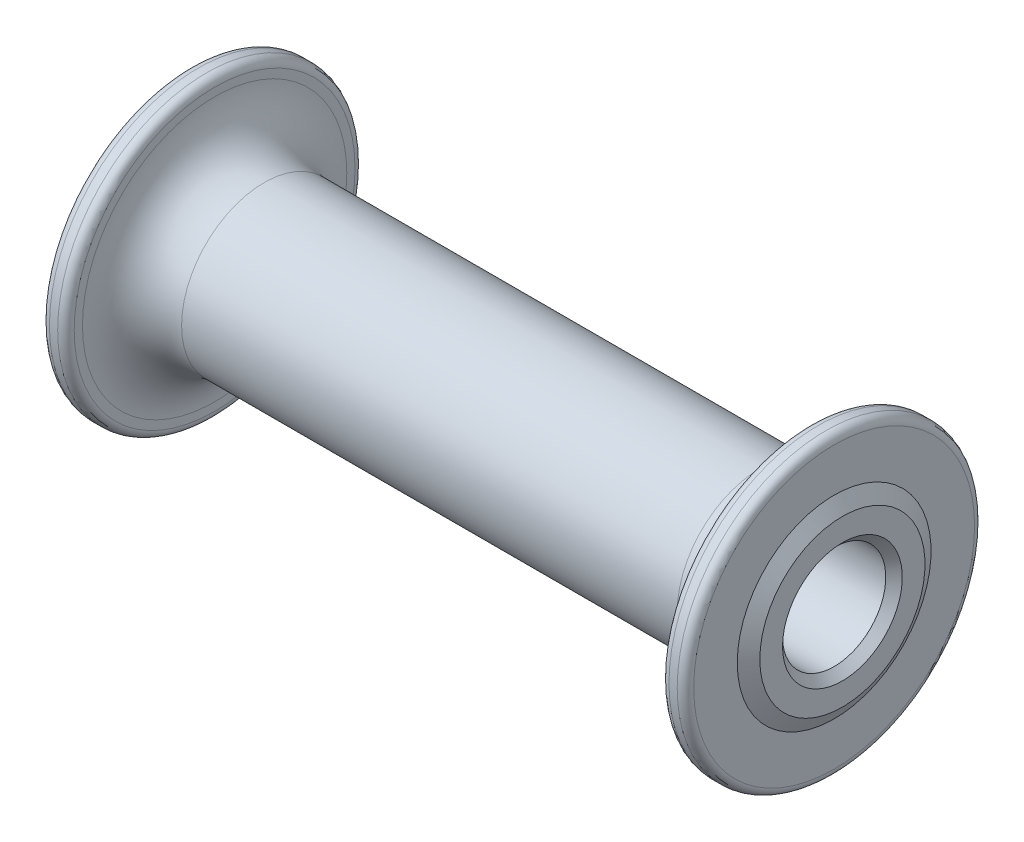
ISO-10303-21;
HEADER;
FILE_DESCRIPTION(('STEP AP214'),'2;1');
FILE_NAME('part.step','',(''),(''),'','','');
FILE_SCHEMA(('AUTOMOTIVE_DESIGN { 1 0 10303 214 1 1 1 1 }'));
ENDSEC;
DATA;
#1=APPLICATION_CONTEXT('core data for automotive mechanical design processes');
#2=APPLICATION_PROTOCOL_DEFINITION('international standard','automotive_design',2000,#1);
#3=PRODUCT_CONTEXT('',#1,'mechanical');
#4=PRODUCT('Part','Part','',(#3));
#5=PRODUCT_RELATED_PRODUCT_CATEGORY('part','',(#4));
#6=PRODUCT_DEFINITION_FORMATION('','',#4);
#7=PRODUCT_DEFINITION_CONTEXT('part definition',#1,'design');
#8=PRODUCT_DEFINITION('design','',#6,#7);
#9=PRODUCT_DEFINITION_SHAPE('','',#8);
#10=(LENGTH_UNIT() NAMED_UNIT(*) SI_UNIT(.MILLI.,.METRE.));
#11=(NAMED_UNIT(*) PLANE_ANGLE_UNIT() SI_UNIT($,.RADIAN.));
#12=(NAMED_UNIT(*) SI_UNIT($,.STERADIAN.) SOLID_ANGLE_UNIT());
#13=UNCERTAINTY_MEASURE_WITH_UNIT(LENGTH_MEASURE(1.E-05),#10,'distance_accuracy_value','');
#14=(GEOMETRIC_REPRESENTATION_CONTEXT(3) GLOBAL_UNCERTAINTY_ASSIGNED_CONTEXT((#13)) GLOBAL_UNIT_ASSIGNED_CONTEXT((#10,
#11,#12)) REPRESENTATION_CONTEXT('',''));
#15=CARTESIAN_POINT('',(0.,0.,0.));
#16=DIRECTION('',(0.,0.,1.));
#17=DIRECTION('',(1.,0.,0.));
#18=AXIS2_PLACEMENT_3D('',#15,#16,#17);
#19=CARTESIAN_POINT('',(40.,0.,0.));
#20=DIRECTION('',(-1.,0.,0.));
#21=DIRECTION('',(0.,0.,1.));
#22=AXIS2_PLACEMENT_3D('',#19,#20,#21);
#23=CONICAL_SURFACE('',#22,10.,1.0471975511966);
#24=CARTESIAN_POINT('',(39.,0.,0.));
#25=DIRECTION('',(-1.,0.,0.));
#26=DIRECTION('',(0.,0.,1.));
#27=AXIS2_PLACEMENT_3D('',#24,#25,#26);
#28=CIRCLE('',#27,11.7320508075689);
#29=CARTESIAN_POINT('',(39.,0.,11.7320508075689));
#30=VERTEX_POINT('',#29);
#31=EDGE_CURVE('E50',#30,#30,#28,.T.);
#32=ORIENTED_EDGE('',*,*,#31,.F.);
#33=EDGE_LOOP('',(#32));
#34=FACE_BOUND('',#33,.T.);
#35=CARTESIAN_POINT('',(40.,0.,0.));
#36=DIRECTION('',(-1.,0.,0.));
#37=DIRECTION('',(0.,0.,1.));
#38=AXIS2_PLACEMENT_3D('',#35,#36,#37);
#39=CIRCLE('',#38,10.);
#40=CARTESIAN_POINT('',(40.,0.,10.));
#41=VERTEX_POINT('',#40);
#42=EDGE_CURVE('E95',#41,#41,#39,.T.);
#43=ORIENTED_EDGE('',*,*,#42,.T.);
#44=EDGE_LOOP('',(#43));
#45=FACE_BOUND('',#44,.T.);
#46=ADVANCED_FACE('F30',(#34,#45),#23,.T.);
#47=CARTESIAN_POINT('',(39.,11.7320508075689,0.));
#48=DIRECTION('',(-1.,0.,0.));
#49=DIRECTION('',(0.,0.,1.));
#50=AXIS2_PLACEMENT_3D('',#47,#48,#49);
#51=PLANE('',#50);
#52=CARTESIAN_POINT('',(39.,0.,0.));
#53=DIRECTION('',(-1.,0.,0.));
#54=DIRECTION('',(0.,0.,1.));
#55=AXIS2_PLACEMENT_3D('',#52,#53,#54);
#56=CIRCLE('',#55,17.);
#57=CARTESIAN_POINT('',(39.,0.,17.));
#58=VERTEX_POINT('',#57);
#59=EDGE_CURVE('E53',#58,#58,#56,.T.);
#60=ORIENTED_EDGE('',*,*,#59,.F.);
#61=EDGE_LOOP('',(#60));
#62=FACE_BOUND('',#61,.T.);
#63=ORIENTED_EDGE('',*,*,#31,.T.);
#64=EDGE_LOOP('',(#63));
#65=FACE_BOUND('',#64,.T.);
#66=ADVANCED_FACE('F114',(#62,#65),#51,.F.);
#67=CARTESIAN_POINT('',(38.,0.,0.));
#68=DIRECTION('',(-1.,0.,0.));
#69=DIRECTION('',(0.,0.,1.));
#70=AXIS2_PLACEMENT_3D('',#67,#68,#69);
#71=TOROIDAL_SURFACE('',#70,17.,1.);
#72=CARTESIAN_POINT('',(38.,0.,0.));
#73=DIRECTION('',(-1.,0.,0.));
#74=DIRECTION('',(0.,0.,1.));
#75=AXIS2_PLACEMENT_3D('',#72,#73,#74);
#76=CIRCLE('',#75,18.);
#77=CARTESIAN_POINT('',(38.,0.,18.));
#78=VERTEX_POINT('',#77);
#79=EDGE_CURVE('E56',#78,#78,#76,.T.);
#80=ORIENTED_EDGE('',*,*,#79,.F.);
#81=EDGE_LOOP('',(#80));
#82=FACE_BOUND('',#81,.T.);
#83=ORIENTED_EDGE('',*,*,#59,.T.);
#84=EDGE_LOOP('',(#83));
#85=FACE_BOUND('',#84,.T.);
#86=ADVANCED_FACE('F120',(#82,#85),#71,.T.);
#87=CARTESIAN_POINT('',(0.,0.,0.));
#88=DIRECTION('',(-1.,0.,0.));
#89=DIRECTION('',(0.,0.,1.));
#90=AXIS2_PLACEMENT_3D('',#87,#88,#89);
#91=CYLINDRICAL_SURFACE('',#90,18.);
#92=CARTESIAN_POINT('',(37.,0.,0.));
#93=DIRECTION('',(-1.,0.,0.));
#94=DIRECTION('',(0.,0.,1.));
#95=AXIS2_PLACEMENT_3D('',#92,#93,#94);
#96=CIRCLE('',#95,18.);
#97=CARTESIAN_POINT('',(37.,0.,18.));
#98=VERTEX_POINT('',#97);
#99=EDGE_CURVE('E59',#98,#98,#96,.T.);
#100=ORIENTED_EDGE('',*,*,#99,.F.);
#101=EDGE_LOOP('',(#100));
#102=FACE_BOUND('',#101,.T.);
#103=ORIENTED_EDGE('',*,*,#79,.T.);
#104=EDGE_LOOP('',(#103));
#105=FACE_BOUND('',#104,.T.);
#106=ADVANCED_FACE('F127',(#102,#105),#91,.T.);
#107=CARTESIAN_POINT('',(37.,0.,0.));
#108=DIRECTION('',(-1.,0.,0.));
#109=DIRECTION('',(0.,0.,1.));
#110=AXIS2_PLACEMENT_3D('',#107,#108,#109);
#111=TOROIDAL_SURFACE('',#110,17.,0.999999999999999);
#112=CARTESIAN_POINT('',(36.,0.,0.));
#113=DIRECTION('',(-1.,0.,0.));
#114=DIRECTION('',(0.,0.,1.));
#115=AXIS2_PLACEMENT_3D('',#112,#113,#114);
#116=CIRCLE('',#115,17.);
#117=CARTESIAN_POINT('',(36.,0.,17.));
#118=VERTEX_POINT('',#117);
#119=EDGE_CURVE('E62',#118,#118,#116,.T.);
#120=ORIENTED_EDGE('',*,*,#119,.F.);
#121=EDGE_LOOP('',(#120));
#122=FACE_BOUND('',#121,.T.);
#123=ORIENTED_EDGE('',*,*,#99,.T.);
#124=EDGE_LOOP('',(#123));
#125=FACE_BOUND('',#124,.T.);
#126=ADVANCED_FACE('F131',(#122,#125),#111,.T.);
#127=CARTESIAN_POINT('',(36.,17.,0.));
#128=DIRECTION('',(1.,0.,0.));
#129=DIRECTION('',(0.,0.,-1.));
#130=AXIS2_PLACEMENT_3D('',#127,#128,#129);
#131=PLANE('',#130);
#132=CARTESIAN_POINT('',(36.,0.,0.));
#133=DIRECTION('',(-1.,0.,0.));
#134=DIRECTION('',(0.,0.,1.));
#135=AXIS2_PLACEMENT_3D('',#132,#133,#134);
#136=CIRCLE('',#135,16.);
#137=CARTESIAN_POINT('',(36.,0.,16.));
#138=VERTEX_POINT('',#137);
#139=EDGE_CURVE('E65',#138,#138,#136,.T.);
#140=ORIENTED_EDGE('',*,*,#139,.F.);
#141=EDGE_LOOP('',(#140));
#142=FACE_BOUND('',#141,.T.);
#143=ORIENTED_EDGE('',*,*,#119,.T.);
#144=EDGE_LOOP('',(#143));
#145=FACE_BOUND('',#144,.T.);
#146=ADVANCED_FACE('F135',(#142,#145),#131,.F.);
#147=CARTESIAN_POINT('',(30.,0.,0.));
#148=DIRECTION('',(-1.,0.,0.));
#149=DIRECTION('',(0.,0.,1.));
#150=AXIS2_PLACEMENT_3D('',#147,#148,#149);
#151=TOROIDAL_SURFACE('',#150,16.,6.00000000000001);
#152=CARTESIAN_POINT('',(30.,0.,0.));
#153=DIRECTION('',(-1.,0.,0.));
#154=DIRECTION('',(0.,0.,1.));
#155=AXIS2_PLACEMENT_3D('',#152,#153,#154);
#156=CIRCLE('',#155,9.99999999999995);
#157=CARTESIAN_POINT('',(30.,0.,9.99999999999995));
#158=VERTEX_POINT('',#157);
#159=EDGE_CURVE('E68',#158,#158,#156,.T.);
#160=ORIENTED_EDGE('',*,*,#159,.F.);
#161=EDGE_LOOP('',(#160));
#162=FACE_BOUND('',#161,.T.);
#163=ORIENTED_EDGE('',*,*,#139,.T.);
#164=EDGE_LOOP('',(#163));
#165=FACE_BOUND('',#164,.T.);
#166=ADVANCED_FACE('F139',(#162,#165),#151,.F.);
#167=CARTESIAN_POINT('',(0.,0.,0.));
#168=DIRECTION('',(-1.,0.,0.));
#169=DIRECTION('',(0.,0.,1.));
#170=AXIS2_PLACEMENT_3D('',#167,#168,#169);
#171=CYLINDRICAL_SURFACE('',#170,9.99999999999995);
#172=CARTESIAN_POINT('',(-30.,0.,0.));
#173=DIRECTION('',(-1.,0.,0.));
#174=DIRECTION('',(0.,0.,1.));
#175=AXIS2_PLACEMENT_3D('',#172,#173,#174);
#176=CIRCLE('',#175,9.99999999999996);
#177=CARTESIAN_POINT('',(-30.,0.,9.99999999999996));
#178=VERTEX_POINT('',#177);
#179=EDGE_CURVE('E71',#178,#178,#176,.T.);
#180=ORIENTED_EDGE('',*,*,#179,.F.);
#181=EDGE_LOOP('',(#180));
#182=FACE_BOUND('',#181,.T.);
#183=ORIENTED_EDGE('',*,*,#159,.T.);
#184=EDGE_LOOP('',(#183));
#185=FACE_BOUND('',#184,.T.);
#186=ADVANCED_FACE('F143',(#182,#185),#171,.T.);
#187=CARTESIAN_POINT('',(-30.,0.,0.));
#188=DIRECTION('',(-1.,0.,0.));
#189=DIRECTION('',(0.,0.,1.));
#190=AXIS2_PLACEMENT_3D('',#187,#188,#189);
#191=TOROIDAL_SURFACE('',#190,16.,6.00000000000001);
#192=CARTESIAN_POINT('',(-36.,0.,0.));
#193=DIRECTION('',(-1.,0.,0.));
#194=DIRECTION('',(0.,0.,1.));
#195=AXIS2_PLACEMENT_3D('',#192,#193,#194);
#196=CIRCLE('',#195,16.);
#197=CARTESIAN_POINT('',(-36.,0.,16.));
#198=VERTEX_POINT('',#197);
#199=EDGE_CURVE('E74',#198,#198,#196,.T.);
#200=ORIENTED_EDGE('',*,*,#199,.F.);
#201=EDGE_LOOP('',(#200));
#202=FACE_BOUND('',#201,.T.);
#203=ORIENTED_EDGE('',*,*,#179,.T.);
#204=EDGE_LOOP('',(#203));
#205=FACE_BOUND('',#204,.T.);
#206=ADVANCED_FACE('F147',(#202,#205),#191,.F.);
#207=CARTESIAN_POINT('',(-36.,17.,0.));
#208=DIRECTION('',(-1.,0.,0.));
#209=DIRECTION('',(0.,0.,1.));
#210=AXIS2_PLACEMENT_3D('',#207,#208,#209);
#211=PLANE('',#210);
#212=CARTESIAN_POINT('',(-36.,0.,0.));
#213=DIRECTION('',(-1.,0.,0.));
#214=DIRECTION('',(0.,0.,1.));
#215=AXIS2_PLACEMENT_3D('',#212,#213,#214);
#216=CIRCLE('',#215,17.);
#217=CARTESIAN_POINT('',(-36.,0.,17.));
#218=VERTEX_POINT('',#217);
#219=EDGE_CURVE('E77',#218,#218,#216,.T.);
#220=ORIENTED_EDGE('',*,*,#219,.F.);
#221=EDGE_LOOP('',(#220));
#222=FACE_BOUND('',#221,.T.);
#223=ORIENTED_EDGE('',*,*,#199,.T.);
#224=EDGE_LOOP('',(#223));
#225=FACE_BOUND('',#224,.T.);
#226=ADVANCED_FACE('F151',(#222,#225),#211,.F.);
#227=CARTESIAN_POINT('',(-37.,0.,0.));
#228=DIRECTION('',(-1.,0.,0.));
#229=DIRECTION('',(0.,0.,1.));
#230=AXIS2_PLACEMENT_3D('',#227,#228,#229);
#231=TOROIDAL_SURFACE('',#230,17.,0.999999999999999);
#232=CARTESIAN_POINT('',(-37.,0.,0.));
#233=DIRECTION('',(-1.,0.,0.));
#234=DIRECTION('',(0.,0.,1.));
#235=AXIS2_PLACEMENT_3D('',#232,#233,#234);
#236=CIRCLE('',#235,18.);
#237=CARTESIAN_POINT('',(-37.,0.,18.));
#238=VERTEX_POINT('',#237);
#239=EDGE_CURVE('E80',#238,#238,#236,.T.);
#240=ORIENTED_EDGE('',*,*,#239,.F.);
#241=EDGE_LOOP('',(#240));
#242=FACE_BOUND('',#241,.T.);
#243=ORIENTED_EDGE('',*,*,#219,.T.);
#244=EDGE_LOOP('',(#243));
#245=FACE_BOUND('',#244,.T.);
#246=ADVANCED_FACE('F155',(#242,#245),#231,.T.);
#247=CARTESIAN_POINT('',(0.,0.,0.));
#248=DIRECTION('',(-1.,0.,0.));
#249=DIRECTION('',(0.,0.,1.));
#250=AXIS2_PLACEMENT_3D('',#247,#248,#249);
#251=CYLINDRICAL_SURFACE('',#250,18.);
#252=CARTESIAN_POINT('',(-38.,0.,0.));
#253=DIRECTION('',(-1.,0.,0.));
#254=DIRECTION('',(0.,0.,1.));
#255=AXIS2_PLACEMENT_3D('',#252,#253,#254);
#256=CIRCLE('',#255,18.);
#257=CARTESIAN_POINT('',(-38.,0.,18.));
#258=VERTEX_POINT('',#257);
#259=EDGE_CURVE('E83',#258,#258,#256,.T.);
#260=ORIENTED_EDGE('',*,*,#259,.F.);
#261=EDGE_LOOP('',(#260));
#262=FACE_BOUND('',#261,.T.);
#263=ORIENTED_EDGE('',*,*,#239,.T.);
#264=EDGE_LOOP('',(#263));
#265=FACE_BOUND('',#264,.T.);
#266=ADVANCED_FACE('F159',(#262,#265),#251,.T.);
#267=CARTESIAN_POINT('',(-38.,0.,0.));
#268=DIRECTION('',(-1.,0.,0.));
#269=DIRECTION('',(0.,0.,1.));
#270=AXIS2_PLACEMENT_3D('',#267,#268,#269);
#271=TOROIDAL_SURFACE('',#270,17.,1.);
#272=CARTESIAN_POINT('',(-39.,0.,0.));
#273=DIRECTION('',(-1.,0.,0.));
#274=DIRECTION('',(0.,0.,1.));
#275=AXIS2_PLACEMENT_3D('',#272,#273,#274);
#276=CIRCLE('',#275,17.);
#277=CARTESIAN_POINT('',(-39.,0.,17.));
#278=VERTEX_POINT('',#277);
#279=EDGE_CURVE('E86',#278,#278,#276,.T.);
#280=ORIENTED_EDGE('',*,*,#279,.F.);
#281=EDGE_LOOP('',(#280));
#282=FACE_BOUND('',#281,.T.);
#283=ORIENTED_EDGE('',*,*,#259,.T.);
#284=EDGE_LOOP('',(#283));
#285=FACE_BOUND('',#284,.T.);
#286=ADVANCED_FACE('F163',(#282,#285),#271,.T.);
#287=CARTESIAN_POINT('',(-39.,11.7320508075689,0.));
#288=DIRECTION('',(1.,0.,0.));
#289=DIRECTION('',(0.,0.,-1.));
#290=AXIS2_PLACEMENT_3D('',#287,#288,#289);
#291=PLANE('',#290);
#292=CARTESIAN_POINT('',(-39.,0.,0.));
#293=DIRECTION('',(-1.,0.,0.));
#294=DIRECTION('',(0.,0.,1.));
#295=AXIS2_PLACEMENT_3D('',#292,#293,#294);
#296=CIRCLE('',#295,11.7320508075689);
#297=CARTESIAN_POINT('',(-39.,0.,11.7320508075689));
#298=VERTEX_POINT('',#297);
#299=EDGE_CURVE('E89',#298,#298,#296,.T.);
#300=ORIENTED_EDGE('',*,*,#299,.F.);
#301=EDGE_LOOP('',(#300));
#302=FACE_BOUND('',#301,.T.);
#303=ORIENTED_EDGE('',*,*,#279,.T.);
#304=EDGE_LOOP('',(#303));
#305=FACE_BOUND('',#304,.T.);
#306=ADVANCED_FACE('F167',(#302,#305),#291,.F.);
#307=CARTESIAN_POINT('',(-39.,0.,0.));
#308=DIRECTION('',(1.,0.,0.));
#309=DIRECTION('',(0.,0.,-1.));
#310=AXIS2_PLACEMENT_3D('',#307,#308,#309);
#311=CONICAL_SURFACE('',#310,11.7320508075689,1.0471975511966);
#312=CARTESIAN_POINT('',(-40.,0.,0.));
#313=DIRECTION('',(-1.,0.,0.));
#314=DIRECTION('',(0.,0.,1.));
#315=AXIS2_PLACEMENT_3D('',#312,#313,#314);
#316=CIRCLE('',#315,10.);
#317=CARTESIAN_POINT('',(-40.,0.,10.));
#318=VERTEX_POINT('',#317);
#319=EDGE_CURVE('E92',#318,#318,#316,.T.);
#320=ORIENTED_EDGE('',*,*,#319,.F.);
#321=EDGE_LOOP('',(#320));
#322=FACE_BOUND('',#321,.T.);
#323=ORIENTED_EDGE('',*,*,#299,.T.);
#324=EDGE_LOOP('',(#323));
#325=FACE_BOUND('',#324,.T.);
#326=ADVANCED_FACE('F171',(#322,#325),#311,.T.);
#327=CARTESIAN_POINT('',(-40.,6.24999999999999,0.));
#328=DIRECTION('',(1.,0.,0.));
#329=DIRECTION('',(0.,0.,-1.));
#330=AXIS2_PLACEMENT_3D('',#327,#328,#329);
#331=PLANE('',#330);
#332=CARTESIAN_POINT('',(-40.,0.,0.));
#333=DIRECTION('',(1.,0.,0.));
#334=DIRECTION('',(0.,0.,-1.));
#335=AXIS2_PLACEMENT_3D('',#332,#333,#334);
#336=CIRCLE('',#335,7.25);
#337=CARTESIAN_POINT('',(-40.,0.,-7.25));
#338=VERTEX_POINT('',#337);
#339=EDGE_CURVE('E37',#338,#338,#336,.T.);
#340=ORIENTED_EDGE('',*,*,#339,.T.);
#341=EDGE_LOOP('',(#340));
#342=FACE_BOUND('',#341,.T.);
#343=ORIENTED_EDGE('',*,*,#319,.T.);
#344=EDGE_LOOP('',(#343));
#345=FACE_BOUND('',#344,.T.);
#346=ADVANCED_FACE('F110',(#342,#345),#331,.F.);
#347=CARTESIAN_POINT('',(0.,0.,0.));
#348=DIRECTION('',(-1.,0.,0.));
#349=DIRECTION('',(0.,0.,1.));
#350=AXIS2_PLACEMENT_3D('',#347,#348,#349);
#351=CYLINDRICAL_SURFACE('',#350,6.24999999999999);
#352=CARTESIAN_POINT('',(-39.,0.,0.));
#353=DIRECTION('',(1.,0.,0.));
#354=DIRECTION('',(0.,0.,-1.));
#355=AXIS2_PLACEMENT_3D('',#352,#353,#354);
#356=CIRCLE('',#355,6.24999999999999);
#357=CARTESIAN_POINT('',(-39.,0.,-6.24999999999999));
#358=VERTEX_POINT('',#357);
#359=EDGE_CURVE('E41',#358,#358,#356,.F.);
#360=ORIENTED_EDGE('',*,*,#359,.T.);
#361=EDGE_LOOP('',(#360));
#362=FACE_BOUND('',#361,.T.);
#363=CARTESIAN_POINT('',(39.,0.,0.));
#364=DIRECTION('',(-1.,0.,0.));
#365=DIRECTION('',(0.,0.,1.));
#366=AXIS2_PLACEMENT_3D('',#363,#364,#365);
#367=CIRCLE('',#366,6.24999999999999);
#368=CARTESIAN_POINT('',(39.,0.,6.24999999999999));
#369=VERTEX_POINT('',#368);
#370=EDGE_CURVE('E45',#369,#369,#367,.F.);
#371=ORIENTED_EDGE('',*,*,#370,.T.);
#372=EDGE_LOOP('',(#371));
#373=FACE_BOUND('',#372,.T.);
#374=ADVANCED_FACE('F103',(#362,#373),#351,.F.);
#375=CARTESIAN_POINT('',(40.,6.24999999999999,0.));
#376=DIRECTION('',(-1.,0.,0.));
#377=DIRECTION('',(0.,0.,1.));
#378=AXIS2_PLACEMENT_3D('',#375,#376,#377);
#379=PLANE('',#378);
#380=CARTESIAN_POINT('',(40.,0.,0.));
#381=DIRECTION('',(-1.,0.,0.));
#382=DIRECTION('',(0.,0.,1.));
#383=AXIS2_PLACEMENT_3D('',#380,#381,#382);
#384=CIRCLE('',#383,7.25);
#385=CARTESIAN_POINT('',(40.,0.,7.25));
#386=VERTEX_POINT('',#385);
#387=EDGE_CURVE('E10',#386,#386,#384,.T.);
#388=ORIENTED_EDGE('',*,*,#387,.T.);
#389=EDGE_LOOP('',(#388));
#390=FACE_BOUND('',#389,.T.);
#391=ORIENTED_EDGE('',*,*,#42,.F.);
#392=EDGE_LOOP('',(#391));
#393=FACE_BOUND('',#392,.T.);
#394=ADVANCED_FACE('F100',(#390,#393),#379,.F.);
#395=CARTESIAN_POINT('',(-39.,0.,0.));
#396=DIRECTION('',(-1.,0.,0.));
#397=DIRECTION('',(0.,0.,1.));
#398=AXIS2_PLACEMENT_3D('',#395,#396,#397);
#399=CONICAL_SURFACE('',#398,6.24999999999999,0.785398163397456);
#400=ORIENTED_EDGE('',*,*,#339,.F.);
#401=EDGE_LOOP('',(#400));
#402=FACE_BOUND('',#401,.T.);
#403=ORIENTED_EDGE('',*,*,#359,.F.);
#404=EDGE_LOOP('',(#403));
#405=FACE_BOUND('',#404,.T.);
#406=ADVANCED_FACE('F102',(#402,#405),#399,.F.);
#407=CARTESIAN_POINT('',(40.,0.,0.));
#408=DIRECTION('',(1.,0.,0.));
#409=DIRECTION('',(0.,0.,-1.));
#410=AXIS2_PLACEMENT_3D('',#407,#408,#409);
#411=CONICAL_SURFACE('',#410,7.25,0.785398163397447);
#412=ORIENTED_EDGE('',*,*,#370,.F.);
#413=EDGE_LOOP('',(#412));
#414=FACE_BOUND('',#413,.T.);
#415=ORIENTED_EDGE('',*,*,#387,.F.);
#416=EDGE_LOOP('',(#415));
#417=FACE_BOUND('',#416,.T.);
#418=ADVANCED_FACE('F32',(#414,#417),#411,.F.);
#419=CLOSED_SHELL('',(#46,#66,#86,#106,#126,#146,#166,#186,#206,#226,#246,#266,#286,#306,#326,
#346,#374,#394,#406,#418));
#420=MANIFOLD_SOLID_BREP('B2',#419);
#421=ADVANCED_BREP_SHAPE_REPRESENTATION('',(#18,#420),#14);
#422=SHAPE_DEFINITION_REPRESENTATION(#9,#421);
ENDSEC;
END-ISO-10303-21;
